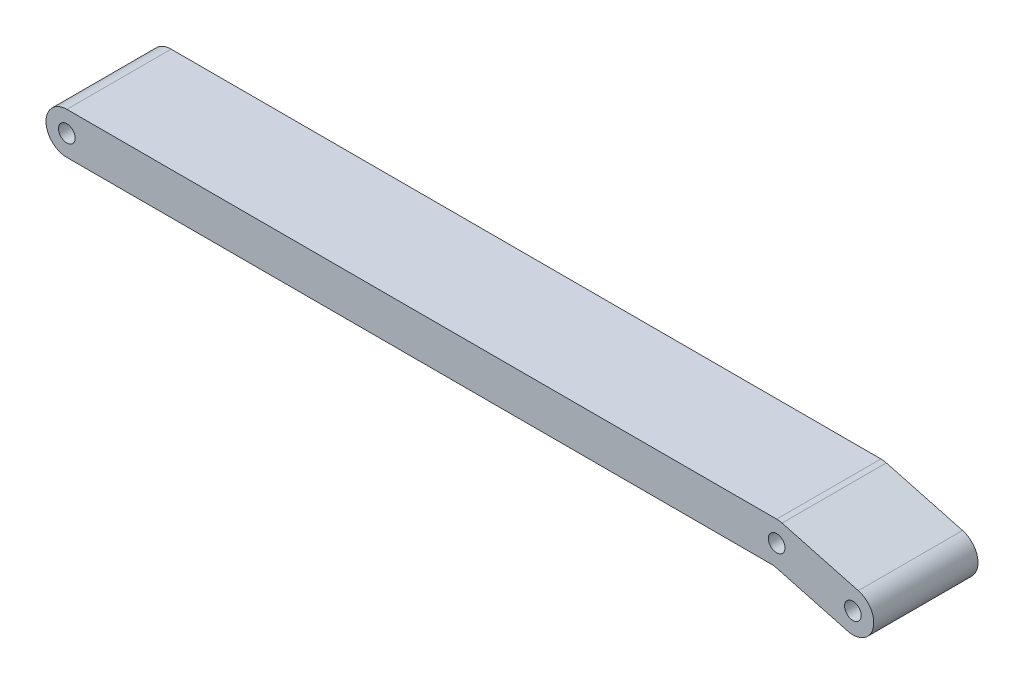
ISO-10303-21;
HEADER;
FILE_DESCRIPTION(('STEP AP214'),'2;1');
FILE_NAME('part.step','',(''),(''),'','','');
FILE_SCHEMA(('AUTOMOTIVE_DESIGN { 1 0 10303 214 1 1 1 1 }'));
ENDSEC;
DATA;
#1=APPLICATION_CONTEXT('core data for automotive mechanical design processes');
#2=APPLICATION_PROTOCOL_DEFINITION('international standard','automotive_design',2000,#1);
#3=PRODUCT_CONTEXT('',#1,'mechanical');
#4=PRODUCT('Part','Part','',(#3));
#5=PRODUCT_RELATED_PRODUCT_CATEGORY('part','',(#4));
#6=PRODUCT_DEFINITION_FORMATION('','',#4);
#7=PRODUCT_DEFINITION_CONTEXT('part definition',#1,'design');
#8=PRODUCT_DEFINITION('design','',#6,#7);
#9=PRODUCT_DEFINITION_SHAPE('','',#8);
#10=(LENGTH_UNIT() NAMED_UNIT(*) SI_UNIT(.MILLI.,.METRE.));
#11=(NAMED_UNIT(*) PLANE_ANGLE_UNIT() SI_UNIT($,.RADIAN.));
#12=(NAMED_UNIT(*) SI_UNIT($,.STERADIAN.) SOLID_ANGLE_UNIT());
#13=UNCERTAINTY_MEASURE_WITH_UNIT(LENGTH_MEASURE(1.E-05),#10,'distance_accuracy_value','');
#14=(GEOMETRIC_REPRESENTATION_CONTEXT(3) GLOBAL_UNCERTAINTY_ASSIGNED_CONTEXT((#13)) GLOBAL_UNIT_ASSIGNED_CONTEXT((#10,
#11,#12)) REPRESENTATION_CONTEXT('',''));
#15=CARTESIAN_POINT('',(0.,0.,0.));
#16=DIRECTION('',(0.,0.,1.));
#17=DIRECTION('',(1.,0.,0.));
#18=AXIS2_PLACEMENT_3D('',#15,#16,#17);
#19=CARTESIAN_POINT('',(76.1593905921655,284.198868770967,50.));
#20=DIRECTION('',(0.258846104417302,0.965918575361292,0.));
#21=DIRECTION('',(-0.965918575361292,0.258846104417302,0.));
#22=AXIS2_PLACEMENT_3D('',#19,#20,#21);
#23=PLANE('',#22);
#24=DIRECTION('',(0.965918575361292,-0.258846104417302,0.));
#25=VECTOR('',#24,1.);
#26=CARTESIAN_POINT('',(76.1593905921655,284.198868770967,0.));
#27=LINE('',#26,#25);
#28=CARTESIAN_POINT('',(94.8133325262736,279.2,0.));
#29=VERTEX_POINT('',#28);
#30=CARTESIAN_POINT('',(130.111538955827,269.740814246387,0.));
#31=VERTEX_POINT('',#30);
#32=EDGE_CURVE('E134',#29,#31,#27,.T.);
#33=ORIENTED_EDGE('',*,*,#32,.T.);
#34=DIRECTION('',(0.,0.,-1.));
#35=VECTOR('',#34,1.);
#36=CARTESIAN_POINT('',(130.111538955827,269.740814246387,50.));
#37=LINE('',#36,#35);
#38=CARTESIAN_POINT('',(130.111538955827,269.740814246387,50.));
#39=VERTEX_POINT('',#38);
#40=EDGE_CURVE('E11',#39,#31,#37,.T.);
#41=ORIENTED_EDGE('',*,*,#40,.F.);
#42=DIRECTION('',(0.965918575361292,-0.258846104417302,0.));
#43=VECTOR('',#42,1.);
#44=CARTESIAN_POINT('',(76.1593905921655,284.198868770967,50.));
#45=LINE('',#44,#43);
#46=CARTESIAN_POINT('',(94.8133325262736,279.2,50.));
#47=VERTEX_POINT('',#46);
#48=EDGE_CURVE('E166',#47,#39,#45,.T.);
#49=ORIENTED_EDGE('',*,*,#48,.F.);
#50=DIRECTION('',(0.,0.,-1.));
#51=VECTOR('',#50,1.);
#52=CARTESIAN_POINT('',(94.8133325262736,279.2,50.));
#53=LINE('',#52,#51);
#54=EDGE_CURVE('E124',#47,#29,#53,.T.);
#55=ORIENTED_EDGE('',*,*,#54,.T.);
#56=EDGE_LOOP('',(#33,#41,#49,#55));
#57=FACE_BOUND('',#56,.T.);
#58=ADVANCED_FACE('F32',(#57),#23,.F.);
#59=CARTESIAN_POINT('',(132.7,279.4,50.));
#60=DIRECTION('',(0.,0.,-1.));
#61=DIRECTION('',(-1.,0.,0.));
#62=AXIS2_PLACEMENT_3D('',#59,#60,#61);
#63=CYLINDRICAL_SURFACE('',#62,9.99999999999993);
#64=CARTESIAN_POINT('',(132.7,279.4,0.));
#65=DIRECTION('',(0.,0.,1.));
#66=DIRECTION('',(1.,0.,0.));
#67=AXIS2_PLACEMENT_3D('',#64,#65,#66);
#68=CIRCLE('',#67,9.99999999999993);
#69=CARTESIAN_POINT('',(135.288461044173,289.059185753613,0.));
#70=VERTEX_POINT('',#69);
#71=EDGE_CURVE('E137',#31,#70,#68,.T.);
#72=ORIENTED_EDGE('',*,*,#71,.T.);
#73=DIRECTION('',(0.,0.,-1.));
#74=VECTOR('',#73,1.);
#75=CARTESIAN_POINT('',(135.288461044173,289.059185753613,50.));
#76=LINE('',#75,#74);
#77=CARTESIAN_POINT('',(135.288461044173,289.059185753613,50.));
#78=VERTEX_POINT('',#77);
#79=EDGE_CURVE('E41',#78,#70,#76,.T.);
#80=ORIENTED_EDGE('',*,*,#79,.F.);
#81=CARTESIAN_POINT('',(132.7,279.4,50.));
#82=DIRECTION('',(0.,0.,1.));
#83=DIRECTION('',(1.,0.,0.));
#84=AXIS2_PLACEMENT_3D('',#81,#82,#83);
#85=CIRCLE('',#84,9.99999999999993);
#86=EDGE_CURVE('E88',#39,#78,#85,.T.);
#87=ORIENTED_EDGE('',*,*,#86,.F.);
#88=ORIENTED_EDGE('',*,*,#40,.T.);
#89=EDGE_LOOP('',(#72,#80,#87,#88));
#90=FACE_BOUND('',#89,.T.);
#91=ADVANCED_FACE('F158',(#90),#63,.T.);
#92=CARTESIAN_POINT('',(81.3363126805113,303.517240278193,50.));
#93=DIRECTION('',(0.258846104417301,0.965918575361292,0.));
#94=DIRECTION('',(-0.965918575361292,0.258846104417301,0.));
#95=AXIS2_PLACEMENT_3D('',#92,#93,#94);
#96=PLANE('',#95);
#97=DIRECTION('',(0.965918575361292,-0.258846104417301,0.));
#98=VECTOR('',#97,1.);
#99=CARTESIAN_POINT('',(81.3363126805113,303.517240278193,0.));
#100=LINE('',#99,#98);
#101=CARTESIAN_POINT('',(98.7184610441729,298.859185753613,0.));
#102=VERTEX_POINT('',#101);
#103=EDGE_CURVE('E140',#102,#70,#100,.T.);
#104=ORIENTED_EDGE('',*,*,#103,.F.);
#105=DIRECTION('',(0.,0.,-1.));
#106=VECTOR('',#105,1.);
#107=CARTESIAN_POINT('',(98.7184610441729,298.859185753613,50.));
#108=LINE('',#107,#106);
#109=CARTESIAN_POINT('',(98.7184610441729,298.859185753613,50.));
#110=VERTEX_POINT('',#109);
#111=EDGE_CURVE('E153',#110,#102,#108,.T.);
#112=ORIENTED_EDGE('',*,*,#111,.F.);
#113=DIRECTION('',(0.965918575361292,-0.258846104417301,0.));
#114=VECTOR('',#113,1.);
#115=CARTESIAN_POINT('',(81.3363126805113,303.517240278193,50.));
#116=LINE('',#115,#114);
#117=EDGE_CURVE('E119',#110,#78,#116,.T.);
#118=ORIENTED_EDGE('',*,*,#117,.T.);
#119=ORIENTED_EDGE('',*,*,#79,.T.);
#120=EDGE_LOOP('',(#104,#112,#118,#119));
#121=FACE_BOUND('',#120,.T.);
#122=ADVANCED_FACE('F157',(#121),#96,.T.);
#123=CARTESIAN_POINT('',(96.13,289.2,50.));
#124=DIRECTION('',(0.,0.,-1.));
#125=DIRECTION('',(-1.,0.,0.));
#126=AXIS2_PLACEMENT_3D('',#123,#124,#125);
#127=CYLINDRICAL_SURFACE('',#126,9.99999999999994);
#128=CARTESIAN_POINT('',(96.13,289.2,0.));
#129=DIRECTION('',(0.,0.,1.));
#130=DIRECTION('',(1.,0.,0.));
#131=AXIS2_PLACEMENT_3D('',#128,#129,#130);
#132=CIRCLE('',#131,9.99999999999994);
#133=CARTESIAN_POINT('',(96.13,299.2,0.));
#134=VERTEX_POINT('',#133);
#135=EDGE_CURVE('E143',#102,#134,#132,.T.);
#136=ORIENTED_EDGE('',*,*,#135,.T.);
#137=DIRECTION('',(0.,0.,-1.));
#138=VECTOR('',#137,1.);
#139=CARTESIAN_POINT('',(96.13,299.2,50.));
#140=LINE('',#139,#138);
#141=CARTESIAN_POINT('',(96.13,299.2,50.));
#142=VERTEX_POINT('',#141);
#143=EDGE_CURVE('E107',#142,#134,#140,.T.);
#144=ORIENTED_EDGE('',*,*,#143,.F.);
#145=CARTESIAN_POINT('',(96.13,289.2,50.));
#146=DIRECTION('',(0.,0.,1.));
#147=DIRECTION('',(1.,0.,0.));
#148=AXIS2_PLACEMENT_3D('',#145,#146,#147);
#149=CIRCLE('',#148,9.99999999999994);
#150=EDGE_CURVE('E116',#110,#142,#149,.T.);
#151=ORIENTED_EDGE('',*,*,#150,.F.);
#152=ORIENTED_EDGE('',*,*,#111,.T.);
#153=EDGE_LOOP('',(#136,#144,#151,#152));
#154=FACE_BOUND('',#153,.T.);
#155=ADVANCED_FACE('F165',(#154),#127,.T.);
#156=CARTESIAN_POINT('',(0.,299.2,50.));
#157=DIRECTION('',(0.,1.,0.));
#158=DIRECTION('',(0.,0.,1.));
#159=AXIS2_PLACEMENT_3D('',#156,#157,#158);
#160=PLANE('',#159);
#161=DIRECTION('',(1.,0.,0.));
#162=VECTOR('',#161,1.);
#163=CARTESIAN_POINT('',(0.,299.2,0.));
#164=LINE('',#163,#162);
#165=CARTESIAN_POINT('',(-244.3,299.2,0.));
#166=VERTEX_POINT('',#165);
#167=EDGE_CURVE('E106',#166,#134,#164,.T.);
#168=ORIENTED_EDGE('',*,*,#167,.F.);
#169=DIRECTION('',(0.,0.,-1.));
#170=VECTOR('',#169,1.);
#171=CARTESIAN_POINT('',(-244.3,299.2,50.));
#172=LINE('',#171,#170);
#173=CARTESIAN_POINT('',(-244.3,299.2,50.));
#174=VERTEX_POINT('',#173);
#175=EDGE_CURVE('E100',#174,#166,#172,.T.);
#176=ORIENTED_EDGE('',*,*,#175,.F.);
#177=DIRECTION('',(1.,0.,0.));
#178=VECTOR('',#177,1.);
#179=CARTESIAN_POINT('',(0.,299.2,50.));
#180=LINE('',#179,#178);
#181=EDGE_CURVE('E104',#174,#142,#180,.T.);
#182=ORIENTED_EDGE('',*,*,#181,.T.);
#183=ORIENTED_EDGE('',*,*,#143,.T.);
#184=EDGE_LOOP('',(#168,#176,#182,#183));
#185=FACE_BOUND('',#184,.T.);
#186=ADVANCED_FACE('F102',(#185),#160,.T.);
#187=CARTESIAN_POINT('',(-244.3,289.2,50.));
#188=DIRECTION('',(0.,0.,-1.));
#189=DIRECTION('',(-1.,0.,0.));
#190=AXIS2_PLACEMENT_3D('',#187,#188,#189);
#191=CYLINDRICAL_SURFACE('',#190,10.);
#192=CARTESIAN_POINT('',(-244.3,289.2,0.));
#193=DIRECTION('',(0.,0.,1.));
#194=DIRECTION('',(1.,0.,0.));
#195=AXIS2_PLACEMENT_3D('',#192,#193,#194);
#196=CIRCLE('',#195,10.);
#197=CARTESIAN_POINT('',(-244.3,279.2,0.));
#198=VERTEX_POINT('',#197);
#199=EDGE_CURVE('E74',#166,#198,#196,.T.);
#200=ORIENTED_EDGE('',*,*,#199,.T.);
#201=DIRECTION('',(0.,0.,-1.));
#202=VECTOR('',#201,1.);
#203=CARTESIAN_POINT('',(-244.3,279.2,50.));
#204=LINE('',#203,#202);
#205=CARTESIAN_POINT('',(-244.3,279.2,50.));
#206=VERTEX_POINT('',#205);
#207=EDGE_CURVE('E108',#206,#198,#204,.T.);
#208=ORIENTED_EDGE('',*,*,#207,.F.);
#209=CARTESIAN_POINT('',(-244.3,289.2,50.));
#210=DIRECTION('',(0.,0.,1.));
#211=DIRECTION('',(1.,0.,0.));
#212=AXIS2_PLACEMENT_3D('',#209,#210,#211);
#213=CIRCLE('',#212,10.);
#214=EDGE_CURVE('E110',#174,#206,#213,.T.);
#215=ORIENTED_EDGE('',*,*,#214,.F.);
#216=ORIENTED_EDGE('',*,*,#175,.T.);
#217=EDGE_LOOP('',(#200,#208,#215,#216));
#218=FACE_BOUND('',#217,.T.);
#219=ADVANCED_FACE('F111',(#218),#191,.T.);
#220=CARTESIAN_POINT('',(-244.3,289.2,50.));
#221=DIRECTION('',(0.,0.,-1.));
#222=DIRECTION('',(-1.,0.,0.));
#223=AXIS2_PLACEMENT_3D('',#220,#221,#222);
#224=CYLINDRICAL_SURFACE('',#223,3.99999999999999);
#225=CARTESIAN_POINT('',(-244.3,289.2,50.));
#226=DIRECTION('',(0.,0.,1.));
#227=DIRECTION('',(1.,0.,0.));
#228=AXIS2_PLACEMENT_3D('',#225,#226,#227);
#229=CIRCLE('',#228,3.99999999999999);
#230=CARTESIAN_POINT('',(-240.3,289.2,50.));
#231=VERTEX_POINT('',#230);
#232=EDGE_CURVE('E170',#231,#231,#229,.T.);
#233=ORIENTED_EDGE('',*,*,#232,.T.);
#234=EDGE_LOOP('',(#233));
#235=FACE_BOUND('',#234,.T.);
#236=CARTESIAN_POINT('',(-244.3,289.2,0.));
#237=DIRECTION('',(0.,0.,1.));
#238=DIRECTION('',(1.,0.,0.));
#239=AXIS2_PLACEMENT_3D('',#236,#237,#238);
#240=CIRCLE('',#239,3.99999999999999);
#241=CARTESIAN_POINT('',(-240.3,289.2,0.));
#242=VERTEX_POINT('',#241);
#243=EDGE_CURVE('E131',#242,#242,#240,.T.);
#244=ORIENTED_EDGE('',*,*,#243,.F.);
#245=EDGE_LOOP('',(#244));
#246=FACE_BOUND('',#245,.T.);
#247=ADVANCED_FACE('F189',(#235,#246),#224,.F.);
#248=CARTESIAN_POINT('',(132.7,279.4,50.));
#249=DIRECTION('',(0.,0.,-1.));
#250=DIRECTION('',(-1.,0.,0.));
#251=AXIS2_PLACEMENT_3D('',#248,#249,#250);
#252=CYLINDRICAL_SURFACE('',#251,3.99999999999999);
#253=CARTESIAN_POINT('',(132.7,279.4,50.));
#254=DIRECTION('',(0.,0.,1.));
#255=DIRECTION('',(1.,0.,0.));
#256=AXIS2_PLACEMENT_3D('',#253,#254,#255);
#257=CIRCLE('',#256,3.99999999999999);
#258=CARTESIAN_POINT('',(136.7,279.4,50.));
#259=VERTEX_POINT('',#258);
#260=EDGE_CURVE('E173',#259,#259,#257,.T.);
#261=ORIENTED_EDGE('',*,*,#260,.T.);
#262=EDGE_LOOP('',(#261));
#263=FACE_BOUND('',#262,.T.);
#264=CARTESIAN_POINT('',(132.7,279.4,0.));
#265=DIRECTION('',(0.,0.,1.));
#266=DIRECTION('',(1.,0.,0.));
#267=AXIS2_PLACEMENT_3D('',#264,#265,#266);
#268=CIRCLE('',#267,3.99999999999999);
#269=CARTESIAN_POINT('',(136.7,279.4,0.));
#270=VERTEX_POINT('',#269);
#271=EDGE_CURVE('E128',#270,#270,#268,.T.);
#272=ORIENTED_EDGE('',*,*,#271,.F.);
#273=EDGE_LOOP('',(#272));
#274=FACE_BOUND('',#273,.T.);
#275=ADVANCED_FACE('F192',(#263,#274),#252,.F.);
#276=CARTESIAN_POINT('',(96.13,289.2,50.));
#277=DIRECTION('',(0.,0.,-1.));
#278=DIRECTION('',(-1.,0.,0.));
#279=AXIS2_PLACEMENT_3D('',#276,#277,#278);
#280=CYLINDRICAL_SURFACE('',#279,4.00000000000001);
#281=CARTESIAN_POINT('',(96.13,289.2,50.));
#282=DIRECTION('',(0.,0.,1.));
#283=DIRECTION('',(1.,0.,0.));
#284=AXIS2_PLACEMENT_3D('',#281,#282,#283);
#285=CIRCLE('',#284,4.00000000000001);
#286=CARTESIAN_POINT('',(100.13,289.2,50.));
#287=VERTEX_POINT('',#286);
#288=EDGE_CURVE('E149',#287,#287,#285,.T.);
#289=ORIENTED_EDGE('',*,*,#288,.T.);
#290=EDGE_LOOP('',(#289));
#291=FACE_BOUND('',#290,.T.);
#292=CARTESIAN_POINT('',(96.13,289.2,0.));
#293=DIRECTION('',(0.,0.,1.));
#294=DIRECTION('',(1.,0.,0.));
#295=AXIS2_PLACEMENT_3D('',#292,#293,#294);
#296=CIRCLE('',#295,4.00000000000001);
#297=CARTESIAN_POINT('',(100.13,289.2,0.));
#298=VERTEX_POINT('',#297);
#299=EDGE_CURVE('E125',#298,#298,#296,.T.);
#300=ORIENTED_EDGE('',*,*,#299,.F.);
#301=EDGE_LOOP('',(#300));
#302=FACE_BOUND('',#301,.T.);
#303=ADVANCED_FACE('F34',(#291,#302),#280,.F.);
#304=CARTESIAN_POINT('',(0.,279.2,50.));
#305=DIRECTION('',(0.,1.,0.));
#306=DIRECTION('',(0.,0.,1.));
#307=AXIS2_PLACEMENT_3D('',#304,#305,#306);
#308=PLANE('',#307);
#309=DIRECTION('',(1.,0.,0.));
#310=VECTOR('',#309,1.);
#311=CARTESIAN_POINT('',(0.,279.2,0.));
#312=LINE('',#311,#310);
#313=EDGE_CURVE('E80',#198,#29,#312,.T.);
#314=ORIENTED_EDGE('',*,*,#313,.T.);
#315=ORIENTED_EDGE('',*,*,#54,.F.);
#316=DIRECTION('',(1.,0.,0.));
#317=VECTOR('',#316,1.);
#318=CARTESIAN_POINT('',(0.,279.2,50.));
#319=LINE('',#318,#317);
#320=EDGE_CURVE('E49',#206,#47,#319,.T.);
#321=ORIENTED_EDGE('',*,*,#320,.F.);
#322=ORIENTED_EDGE('',*,*,#207,.T.);
#323=EDGE_LOOP('',(#314,#315,#321,#322));
#324=FACE_BOUND('',#323,.T.);
#325=ADVANCED_FACE('F183',(#324),#308,.F.);
#326=CARTESIAN_POINT('',(0.,0.,50.));
#327=DIRECTION('',(0.,0.,1.));
#328=DIRECTION('',(1.,0.,0.));
#329=AXIS2_PLACEMENT_3D('',#326,#327,#328);
#330=PLANE('',#329);
#331=ORIENTED_EDGE('',*,*,#288,.F.);
#332=EDGE_LOOP('',(#331));
#333=FACE_BOUND('',#332,.T.);
#334=ORIENTED_EDGE('',*,*,#260,.F.);
#335=EDGE_LOOP('',(#334));
#336=FACE_BOUND('',#335,.T.);
#337=ORIENTED_EDGE('',*,*,#232,.F.);
#338=EDGE_LOOP('',(#337));
#339=FACE_BOUND('',#338,.T.);
#340=ORIENTED_EDGE('',*,*,#48,.T.);
#341=ORIENTED_EDGE('',*,*,#86,.T.);
#342=ORIENTED_EDGE('',*,*,#117,.F.);
#343=ORIENTED_EDGE('',*,*,#150,.T.);
#344=ORIENTED_EDGE('',*,*,#181,.F.);
#345=ORIENTED_EDGE('',*,*,#214,.T.);
#346=ORIENTED_EDGE('',*,*,#320,.T.);
#347=EDGE_LOOP('',(#340,#341,#342,#343,#344,#345,#346));
#348=FACE_BOUND('',#347,.T.);
#349=ADVANCED_FACE('F113',(#333,#336,#339,#348),#330,.T.);
#350=CARTESIAN_POINT('',(0.,0.,0.));
#351=DIRECTION('',(0.,0.,1.));
#352=DIRECTION('',(1.,0.,0.));
#353=AXIS2_PLACEMENT_3D('',#350,#351,#352);
#354=PLANE('',#353);
#355=ORIENTED_EDGE('',*,*,#299,.T.);
#356=EDGE_LOOP('',(#355));
#357=FACE_BOUND('',#356,.T.);
#358=ORIENTED_EDGE('',*,*,#271,.T.);
#359=EDGE_LOOP('',(#358));
#360=FACE_BOUND('',#359,.T.);
#361=ORIENTED_EDGE('',*,*,#243,.T.);
#362=EDGE_LOOP('',(#361));
#363=FACE_BOUND('',#362,.T.);
#364=ORIENTED_EDGE('',*,*,#32,.F.);
#365=ORIENTED_EDGE('',*,*,#313,.F.);
#366=ORIENTED_EDGE('',*,*,#199,.F.);
#367=ORIENTED_EDGE('',*,*,#167,.T.);
#368=ORIENTED_EDGE('',*,*,#135,.F.);
#369=ORIENTED_EDGE('',*,*,#103,.T.);
#370=ORIENTED_EDGE('',*,*,#71,.F.);
#371=EDGE_LOOP('',(#364,#365,#366,#367,#368,#369,#370));
#372=FACE_BOUND('',#371,.T.);
#373=ADVANCED_FACE('F163',(#357,#360,#363,#372),#354,.F.);
#374=CLOSED_SHELL('',(#58,#91,#122,#155,#186,#219,#247,#275,#303,#325,#349,#373));
#375=MANIFOLD_SOLID_BREP('B2',#374);
#376=ADVANCED_BREP_SHAPE_REPRESENTATION('',(#18,#375),#14);
#377=SHAPE_DEFINITION_REPRESENTATION(#9,#376);
ENDSEC;
END-ISO-10303-21;
